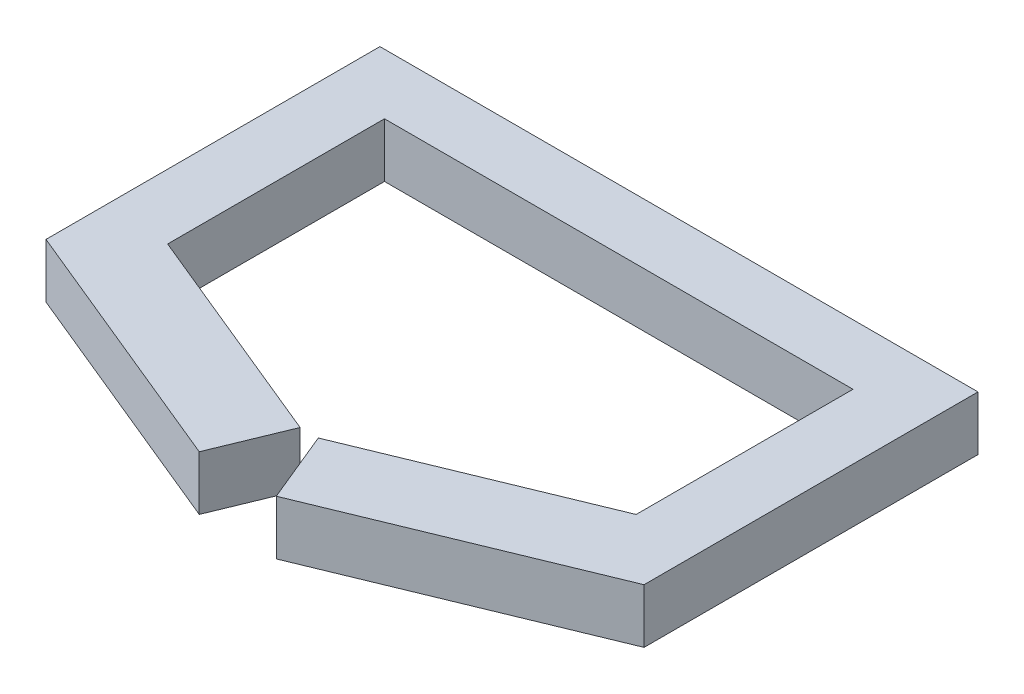
ISO-10303-21;
HEADER;
FILE_DESCRIPTION(('STEP AP214'),'2;1');
FILE_NAME('part.step','',(''),(''),'','','');
FILE_SCHEMA(('AUTOMOTIVE_DESIGN { 1 0 10303 214 1 1 1 1 }'));
ENDSEC;
DATA;
#1=APPLICATION_CONTEXT('core data for automotive mechanical design processes');
#2=APPLICATION_PROTOCOL_DEFINITION('international standard','automotive_design',2000,#1);
#3=PRODUCT_CONTEXT('',#1,'mechanical');
#4=PRODUCT('Part','Part','',(#3));
#5=PRODUCT_RELATED_PRODUCT_CATEGORY('part','',(#4));
#6=PRODUCT_DEFINITION_FORMATION('','',#4);
#7=PRODUCT_DEFINITION_CONTEXT('part definition',#1,'design');
#8=PRODUCT_DEFINITION('design','',#6,#7);
#9=PRODUCT_DEFINITION_SHAPE('','',#8);
#10=(LENGTH_UNIT() NAMED_UNIT(*) SI_UNIT(.MILLI.,.METRE.));
#11=(NAMED_UNIT(*) PLANE_ANGLE_UNIT() SI_UNIT($,.RADIAN.));
#12=(NAMED_UNIT(*) SI_UNIT($,.STERADIAN.) SOLID_ANGLE_UNIT());
#13=UNCERTAINTY_MEASURE_WITH_UNIT(LENGTH_MEASURE(1.E-05),#10,'distance_accuracy_value','');
#14=(GEOMETRIC_REPRESENTATION_CONTEXT(3) GLOBAL_UNCERTAINTY_ASSIGNED_CONTEXT((#13)) GLOBAL_UNIT_ASSIGNED_CONTEXT((#10,
#11,#12)) REPRESENTATION_CONTEXT('',''));
#15=CARTESIAN_POINT('',(0.,0.,0.));
#16=DIRECTION('',(0.,0.,1.));
#17=DIRECTION('',(1.,0.,0.));
#18=AXIS2_PLACEMENT_3D('',#15,#16,#17);
#19=CARTESIAN_POINT('',(-55.0592788387044,10.,27.8292456342756));
#20=DIRECTION('',(0.380749805254294,0.,-0.924678098474716));
#21=DIRECTION('',(-0.924678098474716,0.,-0.380749805254295));
#22=AXIS2_PLACEMENT_3D('',#19,#20,#21);
#23=PLANE('',#22);
#24=DIRECTION('',(0.924678098474716,0.,0.380749805254295));
#25=VECTOR('',#24,1.);
#26=CARTESIAN_POINT('',(-55.0592788387044,0.,27.8292456342756));
#27=LINE('',#26,#25);
#28=CARTESIAN_POINT('',(-55.0592788387044,0.,27.8292456342756));
#29=VERTEX_POINT('',#28);
#30=CARTESIAN_POINT('',(-7.09194458109774,0.,47.5805009168195));
#31=VERTEX_POINT('',#30);
#32=EDGE_CURVE('E153',#29,#31,#27,.T.);
#33=ORIENTED_EDGE('',*,*,#32,.T.);
#34=DIRECTION('',(0.,-1.,0.));
#35=VECTOR('',#34,1.);
#36=CARTESIAN_POINT('',(-7.09194458109774,10.,47.5805009168195));
#37=LINE('',#36,#35);
#38=CARTESIAN_POINT('',(-7.09194458109774,10.,47.5805009168195));
#39=VERTEX_POINT('',#38);
#40=EDGE_CURVE('E11',#39,#31,#37,.T.);
#41=ORIENTED_EDGE('',*,*,#40,.F.);
#42=DIRECTION('',(0.924678098474716,0.,0.380749805254295));
#43=VECTOR('',#42,1.);
#44=CARTESIAN_POINT('',(-55.0592788387044,10.,27.8292456342756));
#45=LINE('',#44,#43);
#46=CARTESIAN_POINT('',(-55.0592788387044,10.,27.8292456342756));
#47=VERTEX_POINT('',#46);
#48=EDGE_CURVE('E175',#47,#39,#45,.T.);
#49=ORIENTED_EDGE('',*,*,#48,.F.);
#50=DIRECTION('',(0.,-1.,0.));
#51=VECTOR('',#50,1.);
#52=CARTESIAN_POINT('',(-55.0592788387044,10.,27.8292456342756));
#53=LINE('',#52,#51);
#54=EDGE_CURVE('E149',#47,#29,#53,.T.);
#55=ORIENTED_EDGE('',*,*,#54,.T.);
#56=EDGE_LOOP('',(#33,#41,#49,#55));
#57=FACE_BOUND('',#56,.T.);
#58=ADVANCED_FACE('F33',(#57),#23,.F.);
#59=CARTESIAN_POINT('',(-7.09194458109774,10.,47.5805009168195));
#60=DIRECTION('',(-0.924678098474716,0.,-0.380749805254295));
#61=DIRECTION('',(-0.380749805254295,0.,0.924678098474716));
#62=AXIS2_PLACEMENT_3D('',#59,#60,#61);
#63=PLANE('',#62);
#64=DIRECTION('',(0.380749805254295,0.,-0.924678098474716));
#65=VECTOR('',#64,1.);
#66=CARTESIAN_POINT('',(-7.09194458109774,0.,47.5805009168195));
#67=LINE('',#66,#65);
#68=CARTESIAN_POINT('',(-1.67627781007765,0.,34.4281673300564));
#69=VERTEX_POINT('',#68);
#70=EDGE_CURVE('E156',#31,#69,#67,.T.);
#71=ORIENTED_EDGE('',*,*,#70,.T.);
#72=DIRECTION('',(0.,-1.,0.));
#73=VECTOR('',#72,1.);
#74=CARTESIAN_POINT('',(-1.67627781007765,10.,34.4281673300564));
#75=LINE('',#74,#73);
#76=CARTESIAN_POINT('',(-1.67627781007765,10.,34.4281673300564));
#77=VERTEX_POINT('',#76);
#78=EDGE_CURVE('E41',#77,#69,#75,.T.);
#79=ORIENTED_EDGE('',*,*,#78,.F.);
#80=DIRECTION('',(0.380749805254295,0.,-0.924678098474716));
#81=VECTOR('',#80,1.);
#82=CARTESIAN_POINT('',(-7.09194458109774,10.,47.5805009168195));
#83=LINE('',#82,#81);
#84=EDGE_CURVE('E104',#39,#77,#83,.T.);
#85=ORIENTED_EDGE('',*,*,#84,.F.);
#86=ORIENTED_EDGE('',*,*,#40,.T.);
#87=EDGE_LOOP('',(#71,#79,#85,#86));
#88=FACE_BOUND('',#87,.T.);
#89=ADVANCED_FACE('F253',(#88),#63,.F.);
#90=CARTESIAN_POINT('',(-1.67627781007765,10.,34.4281673300564));
#91=DIRECTION('',(-0.380749805254295,0.,0.924678098474716));
#92=DIRECTION('',(0.924678098474716,0.,0.380749805254295));
#93=AXIS2_PLACEMENT_3D('',#90,#91,#92);
#94=PLANE('',#93);
#95=DIRECTION('',(-0.924678098474716,0.,-0.380749805254295));
#96=VECTOR('',#95,1.);
#97=CARTESIAN_POINT('',(-1.67627781007765,0.,34.4281673300564));
#98=LINE('',#97,#96);
#99=CARTESIAN_POINT('',(-43.1307730204276,0.,17.3586693022652));
#100=VERTEX_POINT('',#99);
#101=EDGE_CURVE('E158',#69,#100,#98,.T.);
#102=ORIENTED_EDGE('',*,*,#101,.T.);
#103=DIRECTION('',(0.,-1.,0.));
#104=VECTOR('',#103,1.);
#105=CARTESIAN_POINT('',(-43.1307730204276,10.,17.3586693022652));
#106=LINE('',#105,#104);
#107=CARTESIAN_POINT('',(-43.1307730204276,10.,17.3586693022652));
#108=VERTEX_POINT('',#107);
#109=EDGE_CURVE('E194',#108,#100,#106,.T.);
#110=ORIENTED_EDGE('',*,*,#109,.F.);
#111=DIRECTION('',(-0.924678098474716,0.,-0.380749805254295));
#112=VECTOR('',#111,1.);
#113=CARTESIAN_POINT('',(-1.67627781007765,10.,34.4281673300564));
#114=LINE('',#113,#112);
#115=EDGE_CURVE('E202',#77,#108,#114,.T.);
#116=ORIENTED_EDGE('',*,*,#115,.F.);
#117=ORIENTED_EDGE('',*,*,#78,.T.);
#118=EDGE_LOOP('',(#102,#110,#116,#117));
#119=FACE_BOUND('',#118,.T.);
#120=ADVANCED_FACE('F200',(#119),#94,.F.);
#121=CARTESIAN_POINT('',(-43.1307730204276,10.,17.3586693022652));
#122=DIRECTION('',(-1.,0.,0.));
#123=DIRECTION('',(0.,0.,1.));
#124=AXIS2_PLACEMENT_3D('',#121,#122,#123);
#125=PLANE('',#124);
#126=DIRECTION('',(0.,0.,-1.));
#127=VECTOR('',#126,1.);
#128=CARTESIAN_POINT('',(-43.1307730204276,0.,17.3586693022652));
#129=LINE('',#128,#127);
#130=CARTESIAN_POINT('',(-43.1307730204276,0.,-22.5652782125837));
#131=VERTEX_POINT('',#130);
#132=EDGE_CURVE('E160',#100,#131,#129,.T.);
#133=ORIENTED_EDGE('',*,*,#132,.T.);
#134=DIRECTION('',(0.,-1.,0.));
#135=VECTOR('',#134,1.);
#136=CARTESIAN_POINT('',(-43.1307730204276,10.,-22.5652782125837));
#137=LINE('',#136,#135);
#138=CARTESIAN_POINT('',(-43.1307730204276,10.,-22.5652782125837));
#139=VERTEX_POINT('',#138);
#140=EDGE_CURVE('E191',#139,#131,#137,.T.);
#141=ORIENTED_EDGE('',*,*,#140,.F.);
#142=DIRECTION('',(0.,0.,-1.));
#143=VECTOR('',#142,1.);
#144=CARTESIAN_POINT('',(-43.1307730204276,10.,17.3586693022652));
#145=LINE('',#144,#143);
#146=EDGE_CURVE('E220',#108,#139,#145,.T.);
#147=ORIENTED_EDGE('',*,*,#146,.F.);
#148=ORIENTED_EDGE('',*,*,#109,.T.);
#149=EDGE_LOOP('',(#133,#141,#147,#148));
#150=FACE_BOUND('',#149,.T.);
#151=ADVANCED_FACE('F211',(#150),#125,.F.);
#152=CARTESIAN_POINT('',(-43.1307730204276,10.,-22.5652782125837));
#153=DIRECTION('',(0.,0.,-1.));
#154=DIRECTION('',(-1.,0.,0.));
#155=AXIS2_PLACEMENT_3D('',#152,#153,#154);
#156=PLANE('',#155);
#157=DIRECTION('',(1.,0.,0.));
#158=VECTOR('',#157,1.);
#159=CARTESIAN_POINT('',(-43.1307730204276,0.,-22.5652782125837));
#160=LINE('',#159,#158);
#161=CARTESIAN_POINT('',(43.1307730204275,0.,-22.5652782125841));
#162=VERTEX_POINT('',#161);
#163=EDGE_CURVE('E162',#131,#162,#160,.T.);
#164=ORIENTED_EDGE('',*,*,#163,.T.);
#165=DIRECTION('',(0.,-1.,0.));
#166=VECTOR('',#165,1.);
#167=CARTESIAN_POINT('',(43.1307730204275,10.,-22.5652782125841));
#168=LINE('',#167,#166);
#169=CARTESIAN_POINT('',(43.1307730204275,10.,-22.5652782125841));
#170=VERTEX_POINT('',#169);
#171=EDGE_CURVE('E188',#170,#162,#168,.T.);
#172=ORIENTED_EDGE('',*,*,#171,.F.);
#173=DIRECTION('',(1.,0.,0.));
#174=VECTOR('',#173,1.);
#175=CARTESIAN_POINT('',(-43.1307730204276,10.,-22.5652782125837));
#176=LINE('',#175,#174);
#177=EDGE_CURVE('E217',#139,#170,#176,.T.);
#178=ORIENTED_EDGE('',*,*,#177,.F.);
#179=ORIENTED_EDGE('',*,*,#140,.T.);
#180=EDGE_LOOP('',(#164,#172,#178,#179));
#181=FACE_BOUND('',#180,.T.);
#182=ADVANCED_FACE('F215',(#181),#156,.F.);
#183=CARTESIAN_POINT('',(43.1307730204278,10.,17.3586693022649));
#184=DIRECTION('',(1.,0.,0.));
#185=DIRECTION('',(0.,0.,-1.));
#186=AXIS2_PLACEMENT_3D('',#183,#184,#185);
#187=PLANE('',#186);
#188=DIRECTION('',(0.,0.,1.));
#189=VECTOR('',#188,1.);
#190=CARTESIAN_POINT('',(43.1307730204278,0.,17.3586693022649));
#191=LINE('',#190,#189);
#192=CARTESIAN_POINT('',(43.1307730204278,0.,17.3586693022649));
#193=VERTEX_POINT('',#192);
#194=EDGE_CURVE('E164',#162,#193,#191,.T.);
#195=ORIENTED_EDGE('',*,*,#194,.T.);
#196=DIRECTION('',(0.,-1.,0.));
#197=VECTOR('',#196,1.);
#198=CARTESIAN_POINT('',(43.1307730204278,10.,17.3586693022649));
#199=LINE('',#198,#197);
#200=CARTESIAN_POINT('',(43.1307730204278,10.,17.3586693022649));
#201=VERTEX_POINT('',#200);
#202=EDGE_CURVE('E185',#201,#193,#199,.T.);
#203=ORIENTED_EDGE('',*,*,#202,.F.);
#204=DIRECTION('',(0.,0.,1.));
#205=VECTOR('',#204,1.);
#206=CARTESIAN_POINT('',(43.1307730204278,10.,17.3586693022649));
#207=LINE('',#206,#205);
#208=EDGE_CURVE('E219',#170,#201,#207,.T.);
#209=ORIENTED_EDGE('',*,*,#208,.F.);
#210=ORIENTED_EDGE('',*,*,#171,.T.);
#211=EDGE_LOOP('',(#195,#203,#209,#210));
#212=FACE_BOUND('',#211,.T.);
#213=ADVANCED_FACE('F266',(#212),#187,.F.);
#214=CARTESIAN_POINT('',(1.67627781007788,10.,34.4281673300564));
#215=DIRECTION('',(0.380749805254301,0.,0.924678098474714));
#216=DIRECTION('',(0.924678098474714,0.,-0.380749805254301));
#217=AXIS2_PLACEMENT_3D('',#214,#215,#216);
#218=PLANE('',#217);
#219=DIRECTION('',(-0.924678098474713,0.,0.380749805254301));
#220=VECTOR('',#219,1.);
#221=CARTESIAN_POINT('',(1.67627781007788,0.,34.4281673300564));
#222=LINE('',#221,#220);
#223=CARTESIAN_POINT('',(1.67627781007788,0.,34.4281673300564));
#224=VERTEX_POINT('',#223);
#225=EDGE_CURVE('E166',#193,#224,#222,.T.);
#226=ORIENTED_EDGE('',*,*,#225,.T.);
#227=DIRECTION('',(0.,-1.,0.));
#228=VECTOR('',#227,1.);
#229=CARTESIAN_POINT('',(1.67627781007788,10.,34.4281673300564));
#230=LINE('',#229,#228);
#231=CARTESIAN_POINT('',(1.67627781007788,10.,34.4281673300564));
#232=VERTEX_POINT('',#231);
#233=EDGE_CURVE('E182',#232,#224,#230,.T.);
#234=ORIENTED_EDGE('',*,*,#233,.F.);
#235=DIRECTION('',(-0.924678098474713,0.,0.380749805254301));
#236=VECTOR('',#235,1.);
#237=CARTESIAN_POINT('',(1.67627781007788,10.,34.4281673300564));
#238=LINE('',#237,#236);
#239=EDGE_CURVE('E222',#201,#232,#238,.T.);
#240=ORIENTED_EDGE('',*,*,#239,.F.);
#241=ORIENTED_EDGE('',*,*,#202,.T.);
#242=EDGE_LOOP('',(#226,#234,#240,#241));
#243=FACE_BOUND('',#242,.T.);
#244=ADVANCED_FACE('F269',(#243),#218,.F.);
#245=CARTESIAN_POINT('',(7.09194458109807,10.,47.5805009168194));
#246=DIRECTION('',(0.924678098474713,0.,-0.380749805254301));
#247=DIRECTION('',(-0.380749805254301,0.,-0.924678098474714));
#248=AXIS2_PLACEMENT_3D('',#245,#246,#247);
#249=PLANE('',#248);
#250=DIRECTION('',(0.380749805254301,0.,0.924678098474713));
#251=VECTOR('',#250,1.);
#252=CARTESIAN_POINT('',(7.09194458109807,0.,47.5805009168194));
#253=LINE('',#252,#251);
#254=CARTESIAN_POINT('',(7.09194458109807,0.,47.5805009168194));
#255=VERTEX_POINT('',#254);
#256=EDGE_CURVE('E168',#224,#255,#253,.T.);
#257=ORIENTED_EDGE('',*,*,#256,.T.);
#258=DIRECTION('',(0.,-1.,0.));
#259=VECTOR('',#258,1.);
#260=CARTESIAN_POINT('',(7.09194458109807,10.,47.5805009168194));
#261=LINE('',#260,#259);
#262=CARTESIAN_POINT('',(7.09194458109807,10.,47.5805009168194));
#263=VERTEX_POINT('',#262);
#264=EDGE_CURVE('E179',#263,#255,#261,.T.);
#265=ORIENTED_EDGE('',*,*,#264,.F.);
#266=DIRECTION('',(0.380749805254301,0.,0.924678098474713));
#267=VECTOR('',#266,1.);
#268=CARTESIAN_POINT('',(7.09194458109807,10.,47.5805009168194));
#269=LINE('',#268,#267);
#270=EDGE_CURVE('E228',#232,#263,#269,.T.);
#271=ORIENTED_EDGE('',*,*,#270,.F.);
#272=ORIENTED_EDGE('',*,*,#233,.T.);
#273=EDGE_LOOP('',(#257,#265,#271,#272));
#274=FACE_BOUND('',#273,.T.);
#275=ADVANCED_FACE('F234',(#274),#249,.F.);
#276=CARTESIAN_POINT('',(55.0592788387046,10.,27.8292456342752));
#277=DIRECTION('',(-0.380749805254301,0.,-0.924678098474714));
#278=DIRECTION('',(-0.924678098474714,0.,0.380749805254301));
#279=AXIS2_PLACEMENT_3D('',#276,#277,#278);
#280=PLANE('',#279);
#281=DIRECTION('',(0.924678098474714,0.,-0.380749805254301));
#282=VECTOR('',#281,1.);
#283=CARTESIAN_POINT('',(55.0592788387046,0.,27.8292456342752));
#284=LINE('',#283,#282);
#285=CARTESIAN_POINT('',(55.0592788387046,0.,27.8292456342752));
#286=VERTEX_POINT('',#285);
#287=EDGE_CURVE('E170',#255,#286,#284,.T.);
#288=ORIENTED_EDGE('',*,*,#287,.T.);
#289=DIRECTION('',(0.,-1.,0.));
#290=VECTOR('',#289,1.);
#291=CARTESIAN_POINT('',(55.0592788387046,10.,27.8292456342752));
#292=LINE('',#291,#290);
#293=CARTESIAN_POINT('',(55.0592788387046,10.,27.8292456342752));
#294=VERTEX_POINT('',#293);
#295=EDGE_CURVE('E144',#294,#286,#292,.T.);
#296=ORIENTED_EDGE('',*,*,#295,.F.);
#297=DIRECTION('',(0.924678098474714,0.,-0.380749805254301));
#298=VECTOR('',#297,1.);
#299=CARTESIAN_POINT('',(55.0592788387046,10.,27.8292456342752));
#300=LINE('',#299,#298);
#301=EDGE_CURVE('E135',#263,#294,#300,.T.);
#302=ORIENTED_EDGE('',*,*,#301,.F.);
#303=ORIENTED_EDGE('',*,*,#264,.T.);
#304=EDGE_LOOP('',(#288,#296,#302,#303));
#305=FACE_BOUND('',#304,.T.);
#306=ADVANCED_FACE('F238',(#305),#280,.F.);
#307=CARTESIAN_POINT('',(55.0592788387041,10.,-33.6545006484824));
#308=DIRECTION('',(-1.,0.,0.));
#309=DIRECTION('',(0.,0.,1.));
#310=AXIS2_PLACEMENT_3D('',#307,#308,#309);
#311=PLANE('',#310);
#312=DIRECTION('',(0.,0.,-1.));
#313=VECTOR('',#312,1.);
#314=CARTESIAN_POINT('',(55.0592788387041,0.,-33.6545006484824));
#315=LINE('',#314,#313);
#316=CARTESIAN_POINT('',(55.0592788387041,0.,-33.6545006484824));
#317=VERTEX_POINT('',#316);
#318=EDGE_CURVE('E143',#286,#317,#315,.T.);
#319=ORIENTED_EDGE('',*,*,#318,.T.);
#320=DIRECTION('',(0.,-1.,0.));
#321=VECTOR('',#320,1.);
#322=CARTESIAN_POINT('',(55.0592788387041,10.,-33.6545006484824));
#323=LINE('',#322,#321);
#324=CARTESIAN_POINT('',(55.0592788387041,10.,-33.6545006484824));
#325=VERTEX_POINT('',#324);
#326=EDGE_CURVE('E140',#325,#317,#323,.T.);
#327=ORIENTED_EDGE('',*,*,#326,.F.);
#328=DIRECTION('',(0.,0.,-1.));
#329=VECTOR('',#328,1.);
#330=CARTESIAN_POINT('',(55.0592788387041,10.,-33.6545006484824));
#331=LINE('',#330,#329);
#332=EDGE_CURVE('E129',#294,#325,#331,.T.);
#333=ORIENTED_EDGE('',*,*,#332,.F.);
#334=ORIENTED_EDGE('',*,*,#295,.T.);
#335=EDGE_LOOP('',(#319,#327,#333,#334));
#336=FACE_BOUND('',#335,.T.);
#337=ADVANCED_FACE('F141',(#336),#311,.F.);
#338=CARTESIAN_POINT('',(55.0592788387041,10.,-33.6545006484824));
#339=DIRECTION('',(0.,0.,1.));
#340=DIRECTION('',(1.,0.,0.));
#341=AXIS2_PLACEMENT_3D('',#338,#339,#340);
#342=PLANE('',#341);
#343=DIRECTION('',(-1.,0.,0.));
#344=VECTOR('',#343,1.);
#345=CARTESIAN_POINT('',(55.0592788387041,0.,-33.6545006484824));
#346=LINE('',#345,#344);
#347=CARTESIAN_POINT('',(-55.0592788387044,0.,-33.6545006484821));
#348=VERTEX_POINT('',#347);
#349=EDGE_CURVE('E90',#317,#348,#346,.T.);
#350=ORIENTED_EDGE('',*,*,#349,.T.);
#351=DIRECTION('',(0.,-1.,0.));
#352=VECTOR('',#351,1.);
#353=CARTESIAN_POINT('',(-55.0592788387044,10.,-33.6545006484821));
#354=LINE('',#353,#352);
#355=CARTESIAN_POINT('',(-55.0592788387044,10.,-33.6545006484821));
#356=VERTEX_POINT('',#355);
#357=EDGE_CURVE('E145',#356,#348,#354,.T.);
#358=ORIENTED_EDGE('',*,*,#357,.F.);
#359=DIRECTION('',(-1.,0.,0.));
#360=VECTOR('',#359,1.);
#361=CARTESIAN_POINT('',(55.0592788387041,10.,-33.6545006484824));
#362=LINE('',#361,#360);
#363=EDGE_CURVE('E133',#325,#356,#362,.T.);
#364=ORIENTED_EDGE('',*,*,#363,.F.);
#365=ORIENTED_EDGE('',*,*,#326,.T.);
#366=EDGE_LOOP('',(#350,#358,#364,#365));
#367=FACE_BOUND('',#366,.T.);
#368=ADVANCED_FACE('F147',(#367),#342,.F.);
#369=CARTESIAN_POINT('',(-55.0592788387044,10.,-33.6545006484821));
#370=DIRECTION('',(1.,0.,0.));
#371=DIRECTION('',(0.,0.,-1.));
#372=AXIS2_PLACEMENT_3D('',#369,#370,#371);
#373=PLANE('',#372);
#374=DIRECTION('',(0.,0.,1.));
#375=VECTOR('',#374,1.);
#376=CARTESIAN_POINT('',(-55.0592788387044,0.,-33.6545006484821));
#377=LINE('',#376,#375);
#378=EDGE_CURVE('E96',#348,#29,#377,.T.);
#379=ORIENTED_EDGE('',*,*,#378,.T.);
#380=ORIENTED_EDGE('',*,*,#54,.F.);
#381=DIRECTION('',(0.,0.,1.));
#382=VECTOR('',#381,1.);
#383=CARTESIAN_POINT('',(-55.0592788387044,10.,-33.6545006484821));
#384=LINE('',#383,#382);
#385=EDGE_CURVE('E49',#356,#47,#384,.T.);
#386=ORIENTED_EDGE('',*,*,#385,.F.);
#387=ORIENTED_EDGE('',*,*,#357,.T.);
#388=EDGE_LOOP('',(#379,#380,#386,#387));
#389=FACE_BOUND('',#388,.T.);
#390=ADVANCED_FACE('F242',(#389),#373,.F.);
#391=CARTESIAN_POINT('',(0.,10.,0.));
#392=DIRECTION('',(0.,1.,0.));
#393=DIRECTION('',(0.,0.,1.));
#394=AXIS2_PLACEMENT_3D('',#391,#392,#393);
#395=PLANE('',#394);
#396=ORIENTED_EDGE('',*,*,#48,.T.);
#397=ORIENTED_EDGE('',*,*,#84,.T.);
#398=ORIENTED_EDGE('',*,*,#115,.T.);
#399=ORIENTED_EDGE('',*,*,#146,.T.);
#400=ORIENTED_EDGE('',*,*,#177,.T.);
#401=ORIENTED_EDGE('',*,*,#208,.T.);
#402=ORIENTED_EDGE('',*,*,#239,.T.);
#403=ORIENTED_EDGE('',*,*,#270,.T.);
#404=ORIENTED_EDGE('',*,*,#301,.T.);
#405=ORIENTED_EDGE('',*,*,#332,.T.);
#406=ORIENTED_EDGE('',*,*,#363,.T.);
#407=ORIENTED_EDGE('',*,*,#385,.T.);
#408=EDGE_LOOP('',(#396,#397,#398,#399,#400,#401,#402,#403,#404,#405,#406,#407));
#409=FACE_BOUND('',#408,.T.);
#410=ADVANCED_FACE('F131',(#409),#395,.T.);
#411=CARTESIAN_POINT('',(0.,0.,0.));
#412=DIRECTION('',(0.,1.,0.));
#413=DIRECTION('',(0.,0.,1.));
#414=AXIS2_PLACEMENT_3D('',#411,#412,#413);
#415=PLANE('',#414);
#416=ORIENTED_EDGE('',*,*,#32,.F.);
#417=ORIENTED_EDGE('',*,*,#378,.F.);
#418=ORIENTED_EDGE('',*,*,#349,.F.);
#419=ORIENTED_EDGE('',*,*,#318,.F.);
#420=ORIENTED_EDGE('',*,*,#287,.F.);
#421=ORIENTED_EDGE('',*,*,#256,.F.);
#422=ORIENTED_EDGE('',*,*,#225,.F.);
#423=ORIENTED_EDGE('',*,*,#194,.F.);
#424=ORIENTED_EDGE('',*,*,#163,.F.);
#425=ORIENTED_EDGE('',*,*,#132,.F.);
#426=ORIENTED_EDGE('',*,*,#101,.F.);
#427=ORIENTED_EDGE('',*,*,#70,.F.);
#428=EDGE_LOOP('',(#416,#417,#418,#419,#420,#421,#422,#423,#424,#425,#426,#427));
#429=FACE_BOUND('',#428,.T.);
#430=ADVANCED_FACE('F206',(#429),#415,.F.);
#431=CLOSED_SHELL('',(#58,#89,#120,#151,#182,#213,#244,#275,#306,#337,#368,#390,#410,#430));
#432=MANIFOLD_SOLID_BREP('B2',#431);
#433=ADVANCED_BREP_SHAPE_REPRESENTATION('',(#18,#432),#14);
#434=SHAPE_DEFINITION_REPRESENTATION(#9,#433);
ENDSEC;
END-ISO-10303-21;
